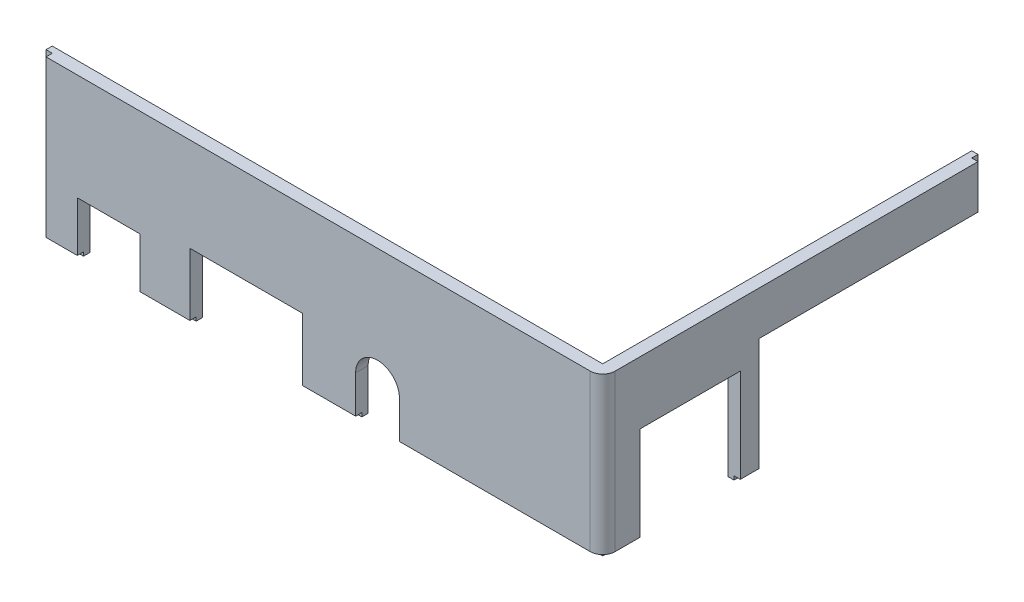
ISO-10303-21;
HEADER;
FILE_DESCRIPTION(('STEP AP214'),'2;1');
FILE_NAME('part.step','',(''),(''),'','','');
FILE_SCHEMA(('AUTOMOTIVE_DESIGN { 1 0 10303 214 1 1 1 1 }'));
ENDSEC;
DATA;
#1=APPLICATION_CONTEXT('core data for automotive mechanical design processes');
#2=APPLICATION_PROTOCOL_DEFINITION('international standard','automotive_design',2000,#1);
#3=PRODUCT_CONTEXT('',#1,'mechanical');
#4=PRODUCT('Part','Part','',(#3));
#5=PRODUCT_RELATED_PRODUCT_CATEGORY('part','',(#4));
#6=PRODUCT_DEFINITION_FORMATION('','',#4);
#7=PRODUCT_DEFINITION_CONTEXT('part definition',#1,'design');
#8=PRODUCT_DEFINITION('design','',#6,#7);
#9=PRODUCT_DEFINITION_SHAPE('','',#8);
#10=(LENGTH_UNIT() NAMED_UNIT(*) SI_UNIT(.MILLI.,.METRE.));
#11=(NAMED_UNIT(*) PLANE_ANGLE_UNIT() SI_UNIT($,.RADIAN.));
#12=(NAMED_UNIT(*) SI_UNIT($,.STERADIAN.) SOLID_ANGLE_UNIT());
#13=UNCERTAINTY_MEASURE_WITH_UNIT(LENGTH_MEASURE(1.E-05),#10,'distance_accuracy_value','');
#14=(GEOMETRIC_REPRESENTATION_CONTEXT(3) GLOBAL_UNCERTAINTY_ASSIGNED_CONTEXT((#13)) GLOBAL_UNIT_ASSIGNED_CONTEXT((#10,
#11,#12)) REPRESENTATION_CONTEXT('',''));
#15=CARTESIAN_POINT('',(0.,0.,0.));
#16=DIRECTION('',(0.,0.,1.));
#17=DIRECTION('',(1.,0.,0.));
#18=AXIS2_PLACEMENT_3D('',#15,#16,#17);
#19=CARTESIAN_POINT('',(0.,0.,0.));
#20=DIRECTION('',(0.,1.,0.));
#21=DIRECTION('',(0.,0.,1.));
#22=AXIS2_PLACEMENT_3D('',#19,#20,#21);
#23=PLANE('',#22);
#24=DIRECTION('',(0.,0.,-1.));
#25=VECTOR('',#24,1.);
#26=CARTESIAN_POINT('',(90.,0.,0.));
#27=LINE('',#26,#25);
#28=CARTESIAN_POINT('',(90.,0.,-2.));
#29=VERTEX_POINT('',#28);
#30=CARTESIAN_POINT('',(90.,0.,-6.));
#31=VERTEX_POINT('',#30);
#32=EDGE_CURVE('E359',#29,#31,#27,.T.);
#33=ORIENTED_EDGE('',*,*,#32,.F.);
#34=CARTESIAN_POINT('',(88.,0.,-2.));
#35=DIRECTION('',(0.,1.,0.));
#36=DIRECTION('',(0.,0.,1.));
#37=AXIS2_PLACEMENT_3D('',#34,#35,#36);
#38=CIRCLE('',#37,2.);
#39=CARTESIAN_POINT('',(88.,0.,0.));
#40=VERTEX_POINT('',#39);
#41=EDGE_CURVE('E82',#29,#40,#38,.F.);
#42=ORIENTED_EDGE('',*,*,#41,.T.);
#43=DIRECTION('',(1.,0.,0.));
#44=VECTOR('',#43,1.);
#45=CARTESIAN_POINT('',(0.,0.,0.));
#46=LINE('',#45,#44);
#47=CARTESIAN_POINT('',(57.5,0.,0.));
#48=VERTEX_POINT('',#47);
#49=EDGE_CURVE('E385',#48,#40,#46,.T.);
#50=ORIENTED_EDGE('',*,*,#49,.F.);
#51=DIRECTION('',(0.,0.,1.));
#52=VECTOR('',#51,1.);
#53=CARTESIAN_POINT('',(57.5,0.,-61.001));
#54=LINE('',#53,#52);
#55=CARTESIAN_POINT('',(57.5,0.,-1.));
#56=VERTEX_POINT('',#55);
#57=EDGE_CURVE('E488',#56,#48,#54,.T.);
#58=ORIENTED_EDGE('',*,*,#57,.F.);
#59=DIRECTION('',(1.,0.,0.));
#60=VECTOR('',#59,1.);
#61=CARTESIAN_POINT('',(0.,0.,-1.));
#62=LINE('',#61,#60);
#63=CARTESIAN_POINT('',(89.,0.,-1.));
#64=VERTEX_POINT('',#63);
#65=EDGE_CURVE('E338',#56,#64,#62,.T.);
#66=ORIENTED_EDGE('',*,*,#65,.T.);
#67=DIRECTION('',(0.,0.,1.));
#68=VECTOR('',#67,1.);
#69=CARTESIAN_POINT('',(89.,0.,-61.));
#70=LINE('',#69,#68);
#71=CARTESIAN_POINT('',(89.,0.,-6.));
#72=VERTEX_POINT('',#71);
#73=EDGE_CURVE('E339',#72,#64,#70,.T.);
#74=ORIENTED_EDGE('',*,*,#73,.F.);
#75=DIRECTION('',(-1.,0.,0.));
#76=VECTOR('',#75,1.);
#77=CARTESIAN_POINT('',(-0.001000000000001,0.,-6.));
#78=LINE('',#77,#76);
#79=EDGE_CURVE('E332',#31,#72,#78,.T.);
#80=ORIENTED_EDGE('',*,*,#79,.F.);
#81=EDGE_LOOP('',(#33,#42,#50,#58,#66,#74,#80));
#82=FACE_BOUND('',#81,.T.);
#83=ADVANCED_FACE('F60',(#82),#23,.F.);
#84=CARTESIAN_POINT('',(90.,0.,-22.));
#85=VERTEX_POINT('',#84);
#86=CARTESIAN_POINT('',(90.,0.,-25.));
#87=VERTEX_POINT('',#86);
#88=EDGE_CURVE('E331',#85,#87,#27,.T.);
#89=ORIENTED_EDGE('',*,*,#88,.F.);
#90=DIRECTION('',(1.,0.,0.));
#91=VECTOR('',#90,1.);
#92=CARTESIAN_POINT('',(-0.001000000000001,0.,-22.));
#93=LINE('',#92,#91);
#94=CARTESIAN_POINT('',(89.,0.,-22.));
#95=VERTEX_POINT('',#94);
#96=EDGE_CURVE('E313',#95,#85,#93,.T.);
#97=ORIENTED_EDGE('',*,*,#96,.F.);
#98=CARTESIAN_POINT('',(89.,0.,-25.));
#99=VERTEX_POINT('',#98);
#100=EDGE_CURVE('E329',#99,#95,#70,.T.);
#101=ORIENTED_EDGE('',*,*,#100,.F.);
#102=DIRECTION('',(-1.,0.,0.));
#103=VECTOR('',#102,1.);
#104=CARTESIAN_POINT('',(-0.001000000000001,0.,-25.));
#105=LINE('',#104,#103);
#106=EDGE_CURVE('E937',#87,#99,#105,.T.);
#107=ORIENTED_EDGE('',*,*,#106,.F.);
#108=EDGE_LOOP('',(#89,#97,#101,#107));
#109=FACE_BOUND('',#108,.T.);
#110=ADVANCED_FACE('F327',(#109),#23,.F.);
#111=CARTESIAN_POINT('',(0.,-0.6,0.));
#112=DIRECTION('',(0.,1.,0.));
#113=DIRECTION('',(0.,0.,1.));
#114=AXIS2_PLACEMENT_3D('',#111,#112,#113);
#115=PLANE('',#114);
#116=DIRECTION('',(0.,0.,1.));
#117=VECTOR('',#116,1.);
#118=CARTESIAN_POINT('',(88.,-0.6,-61.));
#119=LINE('',#118,#117);
#120=CARTESIAN_POINT('',(88.,-0.6,-6.));
#121=VERTEX_POINT('',#120);
#122=CARTESIAN_POINT('',(88.,-0.6,-2.));
#123=VERTEX_POINT('',#122);
#124=EDGE_CURVE('E427',#121,#123,#119,.T.);
#125=ORIENTED_EDGE('',*,*,#124,.F.);
#126=DIRECTION('',(1.,0.,0.));
#127=VECTOR('',#126,1.);
#128=CARTESIAN_POINT('',(-0.001000000000001,-0.6,-6.));
#129=LINE('',#128,#127);
#130=CARTESIAN_POINT('',(89.,-0.6,-6.));
#131=VERTEX_POINT('',#130);
#132=EDGE_CURVE('E956',#121,#131,#129,.T.);
#133=ORIENTED_EDGE('',*,*,#132,.T.);
#134=DIRECTION('',(0.,0.,1.));
#135=VECTOR('',#134,1.);
#136=CARTESIAN_POINT('',(89.,-0.6,-61.));
#137=LINE('',#136,#135);
#138=CARTESIAN_POINT('',(89.,-0.6,-1.));
#139=VERTEX_POINT('',#138);
#140=EDGE_CURVE('E348',#131,#139,#137,.T.);
#141=ORIENTED_EDGE('',*,*,#140,.T.);
#142=DIRECTION('',(1.,0.,0.));
#143=VECTOR('',#142,1.);
#144=CARTESIAN_POINT('',(0.,-0.6,-1.));
#145=LINE('',#144,#143);
#146=CARTESIAN_POINT('',(57.5,-0.6,-1.));
#147=VERTEX_POINT('',#146);
#148=EDGE_CURVE('E353',#147,#139,#145,.T.);
#149=ORIENTED_EDGE('',*,*,#148,.F.);
#150=DIRECTION('',(0.,0.,1.));
#151=VECTOR('',#150,1.);
#152=CARTESIAN_POINT('',(57.5,-0.6,-61.001));
#153=LINE('',#152,#151);
#154=CARTESIAN_POINT('',(57.5,-0.6,-2.));
#155=VERTEX_POINT('',#154);
#156=EDGE_CURVE('E511',#155,#147,#153,.T.);
#157=ORIENTED_EDGE('',*,*,#156,.F.);
#158=DIRECTION('',(1.,0.,0.));
#159=VECTOR('',#158,1.);
#160=CARTESIAN_POINT('',(0.,-0.6,-2.));
#161=LINE('',#160,#159);
#162=EDGE_CURVE('E522',#155,#123,#161,.T.);
#163=ORIENTED_EDGE('',*,*,#162,.T.);
#164=EDGE_LOOP('',(#125,#133,#141,#149,#157,#163));
#165=FACE_BOUND('',#164,.T.);
#166=ADVANCED_FACE('F679',(#165),#115,.F.);
#167=CARTESIAN_POINT('',(89.,-0.6,-25.));
#168=VERTEX_POINT('',#167);
#169=CARTESIAN_POINT('',(89.,-0.6,-22.));
#170=VERTEX_POINT('',#169);
#171=EDGE_CURVE('E354',#168,#170,#137,.T.);
#172=ORIENTED_EDGE('',*,*,#171,.T.);
#173=DIRECTION('',(1.,0.,0.));
#174=VECTOR('',#173,1.);
#175=CARTESIAN_POINT('',(-0.001000000000001,-0.599999999999998,-22.));
#176=LINE('',#175,#174);
#177=CARTESIAN_POINT('',(88.,-0.599999999999998,-22.));
#178=VERTEX_POINT('',#177);
#179=EDGE_CURVE('E316',#178,#170,#176,.T.);
#180=ORIENTED_EDGE('',*,*,#179,.F.);
#181=CARTESIAN_POINT('',(88.,-0.6,-25.));
#182=VERTEX_POINT('',#181);
#183=EDGE_CURVE('E428',#182,#178,#119,.T.);
#184=ORIENTED_EDGE('',*,*,#183,.F.);
#185=DIRECTION('',(1.,0.,0.));
#186=VECTOR('',#185,1.);
#187=CARTESIAN_POINT('',(-0.001000000000001,-0.6,-25.));
#188=LINE('',#187,#186);
#189=EDGE_CURVE('E947',#182,#168,#188,.T.);
#190=ORIENTED_EDGE('',*,*,#189,.T.);
#191=EDGE_LOOP('',(#172,#180,#184,#190));
#192=FACE_BOUND('',#191,.T.);
#193=ADVANCED_FACE('F696',(#192),#115,.F.);
#194=CARTESIAN_POINT('',(89.,25.,0.));
#195=DIRECTION('',(1.,0.,0.));
#196=DIRECTION('',(0.,0.,-1.));
#197=AXIS2_PLACEMENT_3D('',#194,#195,#196);
#198=PLANE('',#197);
#199=DIRECTION('',(0.,1.,0.));
#200=VECTOR('',#199,1.);
#201=CARTESIAN_POINT('',(89.,-0.6,-6.));
#202=LINE('',#201,#200);
#203=EDGE_CURVE('E321',#131,#72,#202,.T.);
#204=ORIENTED_EDGE('',*,*,#203,.T.);
#205=ORIENTED_EDGE('',*,*,#73,.T.);
#206=DIRECTION('',(0.,1.,0.));
#207=VECTOR('',#206,1.);
#208=CARTESIAN_POINT('',(89.,-0.6,-1.));
#209=LINE('',#208,#207);
#210=EDGE_CURVE('E350',#139,#64,#209,.T.);
#211=ORIENTED_EDGE('',*,*,#210,.F.);
#212=ORIENTED_EDGE('',*,*,#140,.F.);
#213=EDGE_LOOP('',(#204,#205,#211,#212));
#214=FACE_BOUND('',#213,.T.);
#215=ADVANCED_FACE('F581',(#214),#198,.T.);
#216=DIRECTION('',(0.,-1.,0.));
#217=VECTOR('',#216,1.);
#218=CARTESIAN_POINT('',(89.,-0.599999999999998,-22.));
#219=LINE('',#218,#217);
#220=EDGE_CURVE('E310',#95,#170,#219,.T.);
#221=ORIENTED_EDGE('',*,*,#220,.T.);
#222=ORIENTED_EDGE('',*,*,#171,.F.);
#223=DIRECTION('',(0.,1.,0.));
#224=VECTOR('',#223,1.);
#225=CARTESIAN_POINT('',(89.,-0.6,-25.));
#226=LINE('',#225,#224);
#227=EDGE_CURVE('E337',#168,#99,#226,.T.);
#228=ORIENTED_EDGE('',*,*,#227,.T.);
#229=ORIENTED_EDGE('',*,*,#100,.T.);
#230=EDGE_LOOP('',(#221,#222,#228,#229));
#231=FACE_BOUND('',#230,.T.);
#232=ADVANCED_FACE('F336',(#231),#198,.T.);
#233=CARTESIAN_POINT('',(0.,25.,-1.));
#234=DIRECTION('',(0.,0.,-1.));
#235=DIRECTION('',(-1.,0.,0.));
#236=AXIS2_PLACEMENT_3D('',#233,#234,#235);
#237=PLANE('',#236);
#238=CARTESIAN_POINT('',(0.,-0.6,-1.));
#239=VERTEX_POINT('',#238);
#240=CARTESIAN_POINT('',(5.99999999999999,-0.6,-1.));
#241=VERTEX_POINT('',#240);
#242=EDGE_CURVE('E520',#239,#241,#145,.T.);
#243=ORIENTED_EDGE('',*,*,#242,.T.);
#244=DIRECTION('',(0.,-1.,0.));
#245=VECTOR('',#244,1.);
#246=CARTESIAN_POINT('',(5.99999999999999,8.,-1.));
#247=LINE('',#246,#245);
#248=CARTESIAN_POINT('',(5.99999999999999,0.,-1.));
#249=VERTEX_POINT('',#248);
#250=EDGE_CURVE('E627',#249,#241,#247,.T.);
#251=ORIENTED_EDGE('',*,*,#250,.F.);
#252=CARTESIAN_POINT('',(1.,0.,-1.));
#253=VERTEX_POINT('',#252);
#254=EDGE_CURVE('E344',#253,#249,#62,.T.);
#255=ORIENTED_EDGE('',*,*,#254,.F.);
#256=DIRECTION('',(0.,-1.,0.));
#257=VECTOR('',#256,1.);
#258=CARTESIAN_POINT('',(1.,25.,-1.));
#259=LINE('',#258,#257);
#260=CARTESIAN_POINT('',(1.,25.,-1.));
#261=VERTEX_POINT('',#260);
#262=EDGE_CURVE('E399',#261,#253,#259,.T.);
#263=ORIENTED_EDGE('',*,*,#262,.F.);
#264=DIRECTION('',(1.,0.,0.));
#265=VECTOR('',#264,1.);
#266=CARTESIAN_POINT('',(0.,25.,-1.));
#267=LINE('',#266,#265);
#268=CARTESIAN_POINT('',(0.,25.,-1.));
#269=VERTEX_POINT('',#268);
#270=EDGE_CURVE('E370',#269,#261,#267,.T.);
#271=ORIENTED_EDGE('',*,*,#270,.F.);
#272=DIRECTION('',(0.,-1.,0.));
#273=VECTOR('',#272,1.);
#274=CARTESIAN_POINT('',(0.,25.,-1.));
#275=LINE('',#274,#273);
#276=EDGE_CURVE('E401',#269,#239,#275,.T.);
#277=ORIENTED_EDGE('',*,*,#276,.T.);
#278=EDGE_LOOP('',(#243,#251,#255,#263,#271,#277));
#279=FACE_BOUND('',#278,.T.);
#280=ADVANCED_FACE('F626',(#279),#237,.F.);
#281=CARTESIAN_POINT('',(16.,0.,-1.));
#282=VERTEX_POINT('',#281);
#283=CARTESIAN_POINT('',(24.,0.,-1.));
#284=VERTEX_POINT('',#283);
#285=EDGE_CURVE('E420',#282,#284,#62,.T.);
#286=ORIENTED_EDGE('',*,*,#285,.F.);
#287=DIRECTION('',(0.,1.,0.));
#288=VECTOR('',#287,1.);
#289=CARTESIAN_POINT('',(16.,8.,-1.));
#290=LINE('',#289,#288);
#291=CARTESIAN_POINT('',(16.,-0.599999999999999,-1.));
#292=VERTEX_POINT('',#291);
#293=EDGE_CURVE('E637',#292,#282,#290,.T.);
#294=ORIENTED_EDGE('',*,*,#293,.F.);
#295=CARTESIAN_POINT('',(24.,-0.6,-1.));
#296=VERTEX_POINT('',#295);
#297=EDGE_CURVE('E523',#292,#296,#145,.T.);
#298=ORIENTED_EDGE('',*,*,#297,.T.);
#299=DIRECTION('',(0.,-1.,0.));
#300=VECTOR('',#299,1.);
#301=CARTESIAN_POINT('',(24.,-0.6,-1.));
#302=LINE('',#301,#300);
#303=EDGE_CURVE('E457',#284,#296,#302,.T.);
#304=ORIENTED_EDGE('',*,*,#303,.F.);
#305=EDGE_LOOP('',(#286,#294,#298,#304));
#306=FACE_BOUND('',#305,.T.);
#307=ADVANCED_FACE('F1012',(#306),#237,.F.);
#308=ORIENTED_EDGE('',*,*,#65,.F.);
#309=DIRECTION('',(0.,1.,0.));
#310=VECTOR('',#309,1.);
#311=CARTESIAN_POINT('',(57.5,6.,-1.));
#312=LINE('',#311,#310);
#313=EDGE_CURVE('E491',#147,#56,#312,.T.);
#314=ORIENTED_EDGE('',*,*,#313,.F.);
#315=ORIENTED_EDGE('',*,*,#148,.T.);
#316=ORIENTED_EDGE('',*,*,#210,.T.);
#317=EDGE_LOOP('',(#308,#314,#315,#316));
#318=FACE_BOUND('',#317,.T.);
#319=ADVANCED_FACE('F577',(#318),#237,.F.);
#320=ORIENTED_EDGE('',*,*,#254,.T.);
#321=DIRECTION('',(0.,0.,-1.));
#322=VECTOR('',#321,1.);
#323=CARTESIAN_POINT('',(5.99999999999999,0.,-61.001));
#324=LINE('',#323,#322);
#325=CARTESIAN_POINT('',(5.99999999999999,0.,0.));
#326=VERTEX_POINT('',#325);
#327=EDGE_CURVE('E636',#326,#249,#324,.T.);
#328=ORIENTED_EDGE('',*,*,#327,.F.);
#329=CARTESIAN_POINT('',(1.,0.,0.));
#330=VERTEX_POINT('',#329);
#331=EDGE_CURVE('E387',#330,#326,#46,.T.);
#332=ORIENTED_EDGE('',*,*,#331,.F.);
#333=DIRECTION('',(0.,0.,-1.));
#334=VECTOR('',#333,1.);
#335=CARTESIAN_POINT('',(1.,0.,0.));
#336=LINE('',#335,#334);
#337=EDGE_CURVE('E382',#330,#253,#336,.T.);
#338=ORIENTED_EDGE('',*,*,#337,.T.);
#339=EDGE_LOOP('',(#320,#328,#332,#338));
#340=FACE_BOUND('',#339,.T.);
#341=ADVANCED_FACE('F635',(#340),#23,.F.);
#342=CARTESIAN_POINT('',(16.,0.,0.));
#343=VERTEX_POINT('',#342);
#344=CARTESIAN_POINT('',(24.,0.,0.));
#345=VERTEX_POINT('',#344);
#346=EDGE_CURVE('E390',#343,#345,#46,.T.);
#347=ORIENTED_EDGE('',*,*,#346,.F.);
#348=DIRECTION('',(0.,0.,1.));
#349=VECTOR('',#348,1.);
#350=CARTESIAN_POINT('',(16.,0.,-61.001));
#351=LINE('',#350,#349);
#352=EDGE_CURVE('E479',#282,#343,#351,.T.);
#353=ORIENTED_EDGE('',*,*,#352,.F.);
#354=ORIENTED_EDGE('',*,*,#285,.T.);
#355=DIRECTION('',(0.,0.,-1.));
#356=VECTOR('',#355,1.);
#357=CARTESIAN_POINT('',(24.,0.,-61.001));
#358=LINE('',#357,#356);
#359=EDGE_CURVE('E452',#345,#284,#358,.T.);
#360=ORIENTED_EDGE('',*,*,#359,.F.);
#361=EDGE_LOOP('',(#347,#353,#354,#360));
#362=FACE_BOUND('',#361,.T.);
#363=ADVANCED_FACE('F683',(#362),#23,.F.);
#364=CARTESIAN_POINT('',(0.,-0.6,-2.));
#365=VERTEX_POINT('',#364);
#366=CARTESIAN_POINT('',(5.99999999999999,-0.6,-2.));
#367=VERTEX_POINT('',#366);
#368=EDGE_CURVE('E524',#365,#367,#161,.T.);
#369=ORIENTED_EDGE('',*,*,#368,.T.);
#370=DIRECTION('',(0.,0.,1.));
#371=VECTOR('',#370,1.);
#372=CARTESIAN_POINT('',(5.99999999999999,-0.6,-61.001));
#373=LINE('',#372,#371);
#374=EDGE_CURVE('E447',#367,#241,#373,.T.);
#375=ORIENTED_EDGE('',*,*,#374,.T.);
#376=ORIENTED_EDGE('',*,*,#242,.F.);
#377=DIRECTION('',(0.,0.,-1.));
#378=VECTOR('',#377,1.);
#379=CARTESIAN_POINT('',(0.,-0.6,-1.));
#380=LINE('',#379,#378);
#381=EDGE_CURVE('E386',#239,#365,#380,.T.);
#382=ORIENTED_EDGE('',*,*,#381,.T.);
#383=EDGE_LOOP('',(#369,#375,#376,#382));
#384=FACE_BOUND('',#383,.T.);
#385=ADVANCED_FACE('F623',(#384),#115,.F.);
#386=ORIENTED_EDGE('',*,*,#297,.F.);
#387=DIRECTION('',(0.,0.,1.));
#388=VECTOR('',#387,1.);
#389=CARTESIAN_POINT('',(16.,-0.599999999999999,-61.001));
#390=LINE('',#389,#388);
#391=CARTESIAN_POINT('',(16.,-0.6,-2.));
#392=VERTEX_POINT('',#391);
#393=EDGE_CURVE('E440',#392,#292,#390,.T.);
#394=ORIENTED_EDGE('',*,*,#393,.F.);
#395=CARTESIAN_POINT('',(24.,-0.6,-2.));
#396=VERTEX_POINT('',#395);
#397=EDGE_CURVE('E526',#392,#396,#161,.T.);
#398=ORIENTED_EDGE('',*,*,#397,.T.);
#399=DIRECTION('',(0.,0.,1.));
#400=VECTOR('',#399,1.);
#401=CARTESIAN_POINT('',(24.,-0.6,-61.001));
#402=LINE('',#401,#400);
#403=EDGE_CURVE('E476',#396,#296,#402,.T.);
#404=ORIENTED_EDGE('',*,*,#403,.T.);
#405=EDGE_LOOP('',(#386,#394,#398,#404));
#406=FACE_BOUND('',#405,.T.);
#407=ADVANCED_FACE('F689',(#406),#115,.F.);
#408=DIRECTION('',(0.,0.,-1.));
#409=VECTOR('',#408,1.);
#410=CARTESIAN_POINT('',(89.,18.,-42.));
#411=LINE('',#410,#409);
#412=CARTESIAN_POINT('',(89.,18.,-60.));
#413=VERTEX_POINT('',#412);
#414=CARTESIAN_POINT('',(89.,18.,-61.));
#415=VERTEX_POINT('',#414);
#416=EDGE_CURVE('E610',#413,#415,#411,.T.);
#417=ORIENTED_EDGE('',*,*,#416,.T.);
#418=DIRECTION('',(0.,-1.,0.));
#419=VECTOR('',#418,1.);
#420=CARTESIAN_POINT('',(89.,25.,-61.));
#421=LINE('',#420,#419);
#422=CARTESIAN_POINT('',(89.,25.,-61.));
#423=VERTEX_POINT('',#422);
#424=EDGE_CURVE('E345',#423,#415,#421,.T.);
#425=ORIENTED_EDGE('',*,*,#424,.F.);
#426=DIRECTION('',(0.,0.,1.));
#427=VECTOR('',#426,1.);
#428=CARTESIAN_POINT('',(89.,25.,0.));
#429=LINE('',#428,#427);
#430=CARTESIAN_POINT('',(89.,25.,-60.));
#431=VERTEX_POINT('',#430);
#432=EDGE_CURVE('E355',#423,#431,#429,.T.);
#433=ORIENTED_EDGE('',*,*,#432,.T.);
#434=DIRECTION('',(0.,-1.,0.));
#435=VECTOR('',#434,1.);
#436=CARTESIAN_POINT('',(89.,25.,-60.));
#437=LINE('',#436,#435);
#438=EDGE_CURVE('E381',#431,#413,#437,.T.);
#439=ORIENTED_EDGE('',*,*,#438,.T.);
#440=EDGE_LOOP('',(#417,#425,#433,#439));
#441=FACE_BOUND('',#440,.T.);
#442=ADVANCED_FACE('F609',(#441),#198,.T.);
#443=CARTESIAN_POINT('',(0.,25.,-61.));
#444=DIRECTION('',(0.,0.,1.));
#445=DIRECTION('',(1.,0.,0.));
#446=AXIS2_PLACEMENT_3D('',#443,#444,#445);
#447=PLANE('',#446);
#448=ORIENTED_EDGE('',*,*,#424,.T.);
#449=DIRECTION('',(1.,0.,0.));
#450=VECTOR('',#449,1.);
#451=CARTESIAN_POINT('',(-0.001000000000001,18.,-61.));
#452=LINE('',#451,#450);
#453=CARTESIAN_POINT('',(88.,18.,-61.));
#454=VERTEX_POINT('',#453);
#455=EDGE_CURVE('E614',#454,#415,#452,.T.);
#456=ORIENTED_EDGE('',*,*,#455,.F.);
#457=DIRECTION('',(0.,-1.,0.));
#458=VECTOR('',#457,1.);
#459=CARTESIAN_POINT('',(88.,25.,-61.));
#460=LINE('',#459,#458);
#461=CARTESIAN_POINT('',(88.,25.,-61.));
#462=VERTEX_POINT('',#461);
#463=EDGE_CURVE('E408',#462,#454,#460,.T.);
#464=ORIENTED_EDGE('',*,*,#463,.F.);
#465=DIRECTION('',(-1.,0.,0.));
#466=VECTOR('',#465,1.);
#467=CARTESIAN_POINT('',(0.,25.,-61.));
#468=LINE('',#467,#466);
#469=EDGE_CURVE('E358',#423,#462,#468,.T.);
#470=ORIENTED_EDGE('',*,*,#469,.F.);
#471=EDGE_LOOP('',(#448,#456,#464,#470));
#472=FACE_BOUND('',#471,.T.);
#473=ADVANCED_FACE('F613',(#472),#447,.F.);
#474=CARTESIAN_POINT('',(88.,25.,0.));
#475=DIRECTION('',(-1.,0.,0.));
#476=DIRECTION('',(0.,0.,1.));
#477=AXIS2_PLACEMENT_3D('',#474,#475,#476);
#478=PLANE('',#477);
#479=ORIENTED_EDGE('',*,*,#463,.T.);
#480=DIRECTION('',(0.,0.,1.));
#481=VECTOR('',#480,1.);
#482=CARTESIAN_POINT('',(88.,18.,-25.));
#483=LINE('',#482,#481);
#484=CARTESIAN_POINT('',(88.,18.,-25.));
#485=VERTEX_POINT('',#484);
#486=EDGE_CURVE('E934',#454,#485,#483,.T.);
#487=ORIENTED_EDGE('',*,*,#486,.T.);
#488=DIRECTION('',(0.,-1.,0.));
#489=VECTOR('',#488,1.);
#490=CARTESIAN_POINT('',(88.,-0.6,-25.));
#491=LINE('',#490,#489);
#492=EDGE_CURVE('E936',#485,#182,#491,.T.);
#493=ORIENTED_EDGE('',*,*,#492,.T.);
#494=ORIENTED_EDGE('',*,*,#183,.T.);
#495=DIRECTION('',(0.,1.,0.));
#496=VECTOR('',#495,1.);
#497=CARTESIAN_POINT('',(88.,-0.599999999999998,-22.));
#498=LINE('',#497,#496);
#499=CARTESIAN_POINT('',(88.,15.,-22.));
#500=VERTEX_POINT('',#499);
#501=EDGE_CURVE('E976',#178,#500,#498,.T.);
#502=ORIENTED_EDGE('',*,*,#501,.T.);
#503=DIRECTION('',(0.,0.,1.));
#504=VECTOR('',#503,1.);
#505=CARTESIAN_POINT('',(88.,15.,-6.));
#506=LINE('',#505,#504);
#507=CARTESIAN_POINT('',(88.,15.,-6.));
#508=VERTEX_POINT('',#507);
#509=EDGE_CURVE('E973',#500,#508,#506,.T.);
#510=ORIENTED_EDGE('',*,*,#509,.T.);
#511=DIRECTION('',(0.,-1.,0.));
#512=VECTOR('',#511,1.);
#513=CARTESIAN_POINT('',(88.,-0.6,-6.));
#514=LINE('',#513,#512);
#515=EDGE_CURVE('E322',#508,#121,#514,.T.);
#516=ORIENTED_EDGE('',*,*,#515,.T.);
#517=ORIENTED_EDGE('',*,*,#124,.T.);
#518=DIRECTION('',(0.,-1.,0.));
#519=VECTOR('',#518,1.);
#520=CARTESIAN_POINT('',(88.,25.,-2.));
#521=LINE('',#520,#519);
#522=CARTESIAN_POINT('',(88.,25.,-2.));
#523=VERTEX_POINT('',#522);
#524=EDGE_CURVE('E405',#523,#123,#521,.T.);
#525=ORIENTED_EDGE('',*,*,#524,.F.);
#526=DIRECTION('',(0.,0.,-1.));
#527=VECTOR('',#526,1.);
#528=CARTESIAN_POINT('',(88.,25.,0.));
#529=LINE('',#528,#527);
#530=EDGE_CURVE('E361',#523,#462,#529,.T.);
#531=ORIENTED_EDGE('',*,*,#530,.T.);
#532=EDGE_LOOP('',(#479,#487,#493,#494,#502,#510,#516,#517,#525,#531));
#533=FACE_BOUND('',#532,.T.);
#534=ADVANCED_FACE('F616',(#533),#478,.T.);
#535=CARTESIAN_POINT('',(0.,25.,-2.));
#536=DIRECTION('',(0.,0.,-1.));
#537=DIRECTION('',(-1.,0.,0.));
#538=AXIS2_PLACEMENT_3D('',#535,#536,#537);
#539=PLANE('',#538);
#540=DIRECTION('',(0.,-1.,0.));
#541=VECTOR('',#540,1.);
#542=CARTESIAN_POINT('',(5.99999999999999,8.,-2.));
#543=LINE('',#542,#541);
#544=CARTESIAN_POINT('',(5.99999999999999,8.,-2.));
#545=VERTEX_POINT('',#544);
#546=EDGE_CURVE('E650',#545,#367,#543,.T.);
#547=ORIENTED_EDGE('',*,*,#546,.T.);
#548=ORIENTED_EDGE('',*,*,#368,.F.);
#549=DIRECTION('',(0.,-1.,0.));
#550=VECTOR('',#549,1.);
#551=CARTESIAN_POINT('',(0.,25.,-2.));
#552=LINE('',#551,#550);
#553=CARTESIAN_POINT('',(0.,25.,-2.));
#554=VERTEX_POINT('',#553);
#555=EDGE_CURVE('E403',#554,#365,#552,.T.);
#556=ORIENTED_EDGE('',*,*,#555,.F.);
#557=DIRECTION('',(1.,0.,0.));
#558=VECTOR('',#557,1.);
#559=CARTESIAN_POINT('',(0.,25.,-2.));
#560=LINE('',#559,#558);
#561=EDGE_CURVE('E364',#554,#523,#560,.T.);
#562=ORIENTED_EDGE('',*,*,#561,.T.);
#563=ORIENTED_EDGE('',*,*,#524,.T.);
#564=ORIENTED_EDGE('',*,*,#162,.F.);
#565=DIRECTION('',(0.,1.,0.));
#566=VECTOR('',#565,1.);
#567=CARTESIAN_POINT('',(57.5,6.,-2.));
#568=LINE('',#567,#566);
#569=CARTESIAN_POINT('',(57.5,6.,-2.));
#570=VERTEX_POINT('',#569);
#571=EDGE_CURVE('E496',#155,#570,#568,.T.);
#572=ORIENTED_EDGE('',*,*,#571,.T.);
#573=CARTESIAN_POINT('',(54.,6.,-2.));
#574=DIRECTION('',(0.,0.,-1.));
#575=DIRECTION('',(-1.,0.,0.));
#576=AXIS2_PLACEMENT_3D('',#573,#574,#575);
#577=CIRCLE('',#576,3.5);
#578=CARTESIAN_POINT('',(50.5,6.,-2.));
#579=VERTEX_POINT('',#578);
#580=EDGE_CURVE('E493',#570,#579,#577,.F.);
#581=ORIENTED_EDGE('',*,*,#580,.T.);
#582=DIRECTION('',(0.,-1.,0.));
#583=VECTOR('',#582,1.);
#584=CARTESIAN_POINT('',(50.5,6.,-2.));
#585=LINE('',#584,#583);
#586=CARTESIAN_POINT('',(50.5,-0.6,-2.));
#587=VERTEX_POINT('',#586);
#588=EDGE_CURVE('E453',#579,#587,#585,.T.);
#589=ORIENTED_EDGE('',*,*,#588,.T.);
#590=CARTESIAN_POINT('',(42.,-0.6,-2.));
#591=VERTEX_POINT('',#590);
#592=EDGE_CURVE('E531',#591,#587,#161,.T.);
#593=ORIENTED_EDGE('',*,*,#592,.F.);
#594=DIRECTION('',(0.,1.,0.));
#595=VECTOR('',#594,1.);
#596=CARTESIAN_POINT('',(42.,-0.599999999999998,-2.));
#597=LINE('',#596,#595);
#598=CARTESIAN_POINT('',(42.,10.,-2.));
#599=VERTEX_POINT('',#598);
#600=EDGE_CURVE('E459',#591,#599,#597,.T.);
#601=ORIENTED_EDGE('',*,*,#600,.T.);
#602=DIRECTION('',(-1.,0.,0.));
#603=VECTOR('',#602,1.);
#604=CARTESIAN_POINT('',(24.,10.,-2.));
#605=LINE('',#604,#603);
#606=CARTESIAN_POINT('',(24.,10.,-2.));
#607=VERTEX_POINT('',#606);
#608=EDGE_CURVE('E462',#599,#607,#605,.T.);
#609=ORIENTED_EDGE('',*,*,#608,.T.);
#610=DIRECTION('',(0.,-1.,0.));
#611=VECTOR('',#610,1.);
#612=CARTESIAN_POINT('',(24.,-0.6,-2.));
#613=LINE('',#612,#611);
#614=EDGE_CURVE('E465',#607,#396,#613,.T.);
#615=ORIENTED_EDGE('',*,*,#614,.T.);
#616=ORIENTED_EDGE('',*,*,#397,.F.);
#617=DIRECTION('',(0.,1.,0.));
#618=VECTOR('',#617,1.);
#619=CARTESIAN_POINT('',(16.,8.,-2.));
#620=LINE('',#619,#618);
#621=CARTESIAN_POINT('',(16.,8.,-2.));
#622=VERTEX_POINT('',#621);
#623=EDGE_CURVE('E644',#392,#622,#620,.T.);
#624=ORIENTED_EDGE('',*,*,#623,.T.);
#625=DIRECTION('',(-1.,0.,0.));
#626=VECTOR('',#625,1.);
#627=CARTESIAN_POINT('',(5.99999999999999,8.,-2.));
#628=LINE('',#627,#626);
#629=EDGE_CURVE('E647',#622,#545,#628,.T.);
#630=ORIENTED_EDGE('',*,*,#629,.T.);
#631=EDGE_LOOP('',(#547,#548,#556,#562,#563,#564,#572,#581,#589,#593,#601,#609,#615,#616,#624,#630));
#632=FACE_BOUND('',#631,.T.);
#633=ADVANCED_FACE('F544',(#632),#539,.T.);
#634=CARTESIAN_POINT('',(0.,25.,0.));
#635=DIRECTION('',(-1.,0.,0.));
#636=DIRECTION('',(0.,0.,1.));
#637=AXIS2_PLACEMENT_3D('',#634,#635,#636);
#638=PLANE('',#637);
#639=ORIENTED_EDGE('',*,*,#555,.T.);
#640=ORIENTED_EDGE('',*,*,#381,.F.);
#641=ORIENTED_EDGE('',*,*,#276,.F.);
#642=DIRECTION('',(0.,0.,-1.));
#643=VECTOR('',#642,1.);
#644=CARTESIAN_POINT('',(0.,25.,0.));
#645=LINE('',#644,#643);
#646=EDGE_CURVE('E367',#269,#554,#645,.T.);
#647=ORIENTED_EDGE('',*,*,#646,.T.);
#648=EDGE_LOOP('',(#639,#640,#641,#647));
#649=FACE_BOUND('',#648,.T.);
#650=ADVANCED_FACE('F621',(#649),#638,.T.);
#651=CARTESIAN_POINT('',(42.,0.,-1.));
#652=VERTEX_POINT('',#651);
#653=CARTESIAN_POINT('',(50.5,0.,-1.));
#654=VERTEX_POINT('',#653);
#655=EDGE_CURVE('E342',#652,#654,#62,.T.);
#656=ORIENTED_EDGE('',*,*,#655,.F.);
#657=DIRECTION('',(0.,1.,0.));
#658=VECTOR('',#657,1.);
#659=CARTESIAN_POINT('',(42.,-0.599999999999998,-1.));
#660=LINE('',#659,#658);
#661=CARTESIAN_POINT('',(42.,-0.6,-1.));
#662=VERTEX_POINT('',#661);
#663=EDGE_CURVE('E455',#662,#652,#660,.T.);
#664=ORIENTED_EDGE('',*,*,#663,.F.);
#665=CARTESIAN_POINT('',(50.5,-0.6,-1.));
#666=VERTEX_POINT('',#665);
#667=EDGE_CURVE('E569',#662,#666,#145,.T.);
#668=ORIENTED_EDGE('',*,*,#667,.T.);
#669=DIRECTION('',(0.,-1.,0.));
#670=VECTOR('',#669,1.);
#671=CARTESIAN_POINT('',(50.5,6.,-1.));
#672=LINE('',#671,#670);
#673=EDGE_CURVE('E510',#654,#666,#672,.T.);
#674=ORIENTED_EDGE('',*,*,#673,.F.);
#675=EDGE_LOOP('',(#656,#664,#668,#674));
#676=FACE_BOUND('',#675,.T.);
#677=ADVANCED_FACE('F568',(#676),#237,.F.);
#678=CARTESIAN_POINT('',(1.,25.,0.));
#679=DIRECTION('',(-1.,0.,0.));
#680=DIRECTION('',(0.,0.,1.));
#681=AXIS2_PLACEMENT_3D('',#678,#679,#680);
#682=PLANE('',#681);
#683=ORIENTED_EDGE('',*,*,#337,.F.);
#684=DIRECTION('',(0.,-1.,0.));
#685=VECTOR('',#684,1.);
#686=CARTESIAN_POINT('',(1.,25.,0.));
#687=LINE('',#686,#685);
#688=CARTESIAN_POINT('',(1.,25.,0.));
#689=VERTEX_POINT('',#688);
#690=EDGE_CURVE('E397',#689,#330,#687,.T.);
#691=ORIENTED_EDGE('',*,*,#690,.F.);
#692=DIRECTION('',(0.,0.,-1.));
#693=VECTOR('',#692,1.);
#694=CARTESIAN_POINT('',(1.,25.,0.));
#695=LINE('',#694,#693);
#696=EDGE_CURVE('E372',#689,#261,#695,.T.);
#697=ORIENTED_EDGE('',*,*,#696,.T.);
#698=ORIENTED_EDGE('',*,*,#262,.T.);
#699=EDGE_LOOP('',(#683,#691,#697,#698));
#700=FACE_BOUND('',#699,.T.);
#701=ADVANCED_FACE('F632',(#700),#682,.T.);
#702=CARTESIAN_POINT('',(0.,25.,0.));
#703=DIRECTION('',(0.,0.,-1.));
#704=DIRECTION('',(-1.,0.,0.));
#705=AXIS2_PLACEMENT_3D('',#702,#703,#704);
#706=PLANE('',#705);
#707=ORIENTED_EDGE('',*,*,#49,.T.);
#708=DIRECTION('',(0.,-1.,0.));
#709=VECTOR('',#708,1.);
#710=CARTESIAN_POINT('',(88.,25.,0.));
#711=LINE('',#710,#709);
#712=CARTESIAN_POINT('',(88.,25.,0.));
#713=VERTEX_POINT('',#712);
#714=EDGE_CURVE('E68',#40,#713,#711,.F.);
#715=ORIENTED_EDGE('',*,*,#714,.T.);
#716=DIRECTION('',(1.,0.,0.));
#717=VECTOR('',#716,1.);
#718=CARTESIAN_POINT('',(0.,25.,0.));
#719=LINE('',#718,#717);
#720=EDGE_CURVE('E375',#689,#713,#719,.T.);
#721=ORIENTED_EDGE('',*,*,#720,.F.);
#722=ORIENTED_EDGE('',*,*,#690,.T.);
#723=ORIENTED_EDGE('',*,*,#331,.T.);
#724=DIRECTION('',(0.,-1.,0.));
#725=VECTOR('',#724,1.);
#726=CARTESIAN_POINT('',(5.99999999999999,8.,0.));
#727=LINE('',#726,#725);
#728=CARTESIAN_POINT('',(5.99999999999999,8.,0.));
#729=VERTEX_POINT('',#728);
#730=EDGE_CURVE('E652',#729,#326,#727,.T.);
#731=ORIENTED_EDGE('',*,*,#730,.F.);
#732=DIRECTION('',(-1.,0.,0.));
#733=VECTOR('',#732,1.);
#734=CARTESIAN_POINT('',(5.99999999999999,8.,0.));
#735=LINE('',#734,#733);
#736=CARTESIAN_POINT('',(16.,8.,0.));
#737=VERTEX_POINT('',#736);
#738=EDGE_CURVE('E443',#737,#729,#735,.T.);
#739=ORIENTED_EDGE('',*,*,#738,.F.);
#740=DIRECTION('',(0.,1.,0.));
#741=VECTOR('',#740,1.);
#742=CARTESIAN_POINT('',(16.,8.,0.));
#743=LINE('',#742,#741);
#744=EDGE_CURVE('E653',#343,#737,#743,.T.);
#745=ORIENTED_EDGE('',*,*,#744,.F.);
#746=ORIENTED_EDGE('',*,*,#346,.T.);
#747=DIRECTION('',(0.,-1.,0.));
#748=VECTOR('',#747,1.);
#749=CARTESIAN_POINT('',(24.,-0.6,0.));
#750=LINE('',#749,#748);
#751=CARTESIAN_POINT('',(24.,10.,0.));
#752=VERTEX_POINT('',#751);
#753=EDGE_CURVE('E468',#752,#345,#750,.T.);
#754=ORIENTED_EDGE('',*,*,#753,.F.);
#755=DIRECTION('',(-1.,0.,0.));
#756=VECTOR('',#755,1.);
#757=CARTESIAN_POINT('',(24.,10.,0.));
#758=LINE('',#757,#756);
#759=CARTESIAN_POINT('',(42.,10.,0.));
#760=VERTEX_POINT('',#759);
#761=EDGE_CURVE('E473',#760,#752,#758,.T.);
#762=ORIENTED_EDGE('',*,*,#761,.F.);
#763=DIRECTION('',(0.,1.,0.));
#764=VECTOR('',#763,1.);
#765=CARTESIAN_POINT('',(42.,-0.599999999999998,0.));
#766=LINE('',#765,#764);
#767=CARTESIAN_POINT('',(42.,0.,0.));
#768=VERTEX_POINT('',#767);
#769=EDGE_CURVE('E470',#768,#760,#766,.T.);
#770=ORIENTED_EDGE('',*,*,#769,.F.);
#771=CARTESIAN_POINT('',(50.5,0.,0.));
#772=VERTEX_POINT('',#771);
#773=EDGE_CURVE('E558',#768,#772,#46,.T.);
#774=ORIENTED_EDGE('',*,*,#773,.T.);
#775=DIRECTION('',(0.,-1.,0.));
#776=VECTOR('',#775,1.);
#777=CARTESIAN_POINT('',(50.5,6.,0.));
#778=LINE('',#777,#776);
#779=CARTESIAN_POINT('',(50.5,6.,0.));
#780=VERTEX_POINT('',#779);
#781=EDGE_CURVE('E502',#780,#772,#778,.T.);
#782=ORIENTED_EDGE('',*,*,#781,.F.);
#783=CARTESIAN_POINT('',(54.,6.,0.));
#784=DIRECTION('',(0.,0.,1.));
#785=DIRECTION('',(-1.,0.,0.));
#786=AXIS2_PLACEMENT_3D('',#783,#784,#785);
#787=CIRCLE('',#786,3.5);
#788=CARTESIAN_POINT('',(57.5,6.,0.));
#789=VERTEX_POINT('',#788);
#790=EDGE_CURVE('E499',#789,#780,#787,.T.);
#791=ORIENTED_EDGE('',*,*,#790,.F.);
#792=DIRECTION('',(0.,1.,0.));
#793=VECTOR('',#792,1.);
#794=CARTESIAN_POINT('',(57.5,6.,0.));
#795=LINE('',#794,#793);
#796=EDGE_CURVE('E504',#48,#789,#795,.T.);
#797=ORIENTED_EDGE('',*,*,#796,.F.);
#798=EDGE_LOOP('',(#707,#715,#721,#722,#723,#731,#739,#745,#746,#754,#762,#770,#774,#782,#791,#797));
#799=FACE_BOUND('',#798,.T.);
#800=ADVANCED_FACE('F555',(#799),#706,.F.);
#801=CARTESIAN_POINT('',(90.,25.,0.));
#802=DIRECTION('',(-1.,0.,0.));
#803=DIRECTION('',(0.,0.,1.));
#804=AXIS2_PLACEMENT_3D('',#801,#802,#803);
#805=PLANE('',#804);
#806=DIRECTION('',(0.,0.,1.));
#807=VECTOR('',#806,1.);
#808=CARTESIAN_POINT('',(90.,18.,-25.));
#809=LINE('',#808,#807);
#810=CARTESIAN_POINT('',(90.,18.,-60.));
#811=VERTEX_POINT('',#810);
#812=CARTESIAN_POINT('',(90.,18.,-25.));
#813=VERTEX_POINT('',#812);
#814=EDGE_CURVE('E597',#811,#813,#809,.T.);
#815=ORIENTED_EDGE('',*,*,#814,.F.);
#816=DIRECTION('',(0.,-1.,0.));
#817=VECTOR('',#816,1.);
#818=CARTESIAN_POINT('',(90.,25.,-60.));
#819=LINE('',#818,#817);
#820=CARTESIAN_POINT('',(90.,25.,-60.));
#821=VERTEX_POINT('',#820);
#822=EDGE_CURVE('E394',#821,#811,#819,.T.);
#823=ORIENTED_EDGE('',*,*,#822,.F.);
#824=DIRECTION('',(0.,0.,-1.));
#825=VECTOR('',#824,1.);
#826=CARTESIAN_POINT('',(90.,25.,0.));
#827=LINE('',#826,#825);
#828=CARTESIAN_POINT('',(90.,25.,-2.));
#829=VERTEX_POINT('',#828);
#830=EDGE_CURVE('E377',#829,#821,#827,.T.);
#831=ORIENTED_EDGE('',*,*,#830,.F.);
#832=DIRECTION('',(0.,-1.,0.));
#833=VECTOR('',#832,1.);
#834=CARTESIAN_POINT('',(90.,25.,-2.));
#835=LINE('',#834,#833);
#836=EDGE_CURVE('E413',#829,#29,#835,.T.);
#837=ORIENTED_EDGE('',*,*,#836,.T.);
#838=ORIENTED_EDGE('',*,*,#32,.T.);
#839=DIRECTION('',(0.,-1.,0.));
#840=VECTOR('',#839,1.);
#841=CARTESIAN_POINT('',(90.,-0.6,-6.));
#842=LINE('',#841,#840);
#843=CARTESIAN_POINT('',(90.,15.,-6.));
#844=VERTEX_POINT('',#843);
#845=EDGE_CURVE('E968',#844,#31,#842,.T.);
#846=ORIENTED_EDGE('',*,*,#845,.F.);
#847=DIRECTION('',(0.,0.,1.));
#848=VECTOR('',#847,1.);
#849=CARTESIAN_POINT('',(90.,15.,-6.));
#850=LINE('',#849,#848);
#851=CARTESIAN_POINT('',(90.,15.,-22.));
#852=VERTEX_POINT('',#851);
#853=EDGE_CURVE('E961',#852,#844,#850,.T.);
#854=ORIENTED_EDGE('',*,*,#853,.F.);
#855=DIRECTION('',(0.,1.,0.));
#856=VECTOR('',#855,1.);
#857=CARTESIAN_POINT('',(90.,-0.599999999999998,-22.));
#858=LINE('',#857,#856);
#859=EDGE_CURVE('E966',#85,#852,#858,.T.);
#860=ORIENTED_EDGE('',*,*,#859,.F.);
#861=ORIENTED_EDGE('',*,*,#88,.T.);
#862=DIRECTION('',(0.,-1.,0.));
#863=VECTOR('',#862,1.);
#864=CARTESIAN_POINT('',(90.,-0.6,-25.));
#865=LINE('',#864,#863);
#866=EDGE_CURVE('E944',#813,#87,#865,.T.);
#867=ORIENTED_EDGE('',*,*,#866,.F.);
#868=EDGE_LOOP('',(#815,#823,#831,#837,#838,#846,#854,#860,#861,#867));
#869=FACE_BOUND('',#868,.T.);
#870=ADVANCED_FACE('F593',(#869),#805,.F.);
#871=CARTESIAN_POINT('',(0.,25.,-60.));
#872=DIRECTION('',(0.,0.,1.));
#873=DIRECTION('',(1.,0.,0.));
#874=AXIS2_PLACEMENT_3D('',#871,#872,#873);
#875=PLANE('',#874);
#876=ORIENTED_EDGE('',*,*,#822,.T.);
#877=DIRECTION('',(1.,0.,0.));
#878=VECTOR('',#877,1.);
#879=CARTESIAN_POINT('',(-0.001000000000001,18.,-60.));
#880=LINE('',#879,#878);
#881=EDGE_CURVE('E951',#413,#811,#880,.T.);
#882=ORIENTED_EDGE('',*,*,#881,.F.);
#883=ORIENTED_EDGE('',*,*,#438,.F.);
#884=DIRECTION('',(-1.,0.,0.));
#885=VECTOR('',#884,1.);
#886=CARTESIAN_POINT('',(0.,25.,-60.));
#887=LINE('',#886,#885);
#888=EDGE_CURVE('E379',#821,#431,#887,.T.);
#889=ORIENTED_EDGE('',*,*,#888,.F.);
#890=EDGE_LOOP('',(#876,#882,#883,#889));
#891=FACE_BOUND('',#890,.T.);
#892=ADVANCED_FACE('F602',(#891),#875,.F.);
#893=CARTESIAN_POINT('',(0.,25.,0.));
#894=DIRECTION('',(0.,1.,0.));
#895=DIRECTION('',(0.,0.,1.));
#896=AXIS2_PLACEMENT_3D('',#893,#894,#895);
#897=PLANE('',#896);
#898=ORIENTED_EDGE('',*,*,#720,.T.);
#899=CARTESIAN_POINT('',(88.,25.,-2.));
#900=DIRECTION('',(0.,1.,0.));
#901=DIRECTION('',(0.,0.,1.));
#902=AXIS2_PLACEMENT_3D('',#899,#900,#901);
#903=CIRCLE('',#902,2.);
#904=EDGE_CURVE('E12',#713,#829,#903,.T.);
#905=ORIENTED_EDGE('',*,*,#904,.T.);
#906=ORIENTED_EDGE('',*,*,#830,.T.);
#907=ORIENTED_EDGE('',*,*,#888,.T.);
#908=ORIENTED_EDGE('',*,*,#432,.F.);
#909=ORIENTED_EDGE('',*,*,#469,.T.);
#910=ORIENTED_EDGE('',*,*,#530,.F.);
#911=ORIENTED_EDGE('',*,*,#561,.F.);
#912=ORIENTED_EDGE('',*,*,#646,.F.);
#913=ORIENTED_EDGE('',*,*,#270,.T.);
#914=ORIENTED_EDGE('',*,*,#696,.F.);
#915=EDGE_LOOP('',(#898,#905,#906,#907,#908,#909,#910,#911,#912,#913,#914));
#916=FACE_BOUND('',#915,.T.);
#917=ADVANCED_FACE('F590',(#916),#897,.T.);
#918=ORIENTED_EDGE('',*,*,#773,.F.);
#919=DIRECTION('',(0.,0.,1.));
#920=VECTOR('',#919,1.);
#921=CARTESIAN_POINT('',(42.,0.,-61.001));
#922=LINE('',#921,#920);
#923=EDGE_CURVE('E450',#652,#768,#922,.T.);
#924=ORIENTED_EDGE('',*,*,#923,.F.);
#925=ORIENTED_EDGE('',*,*,#655,.T.);
#926=DIRECTION('',(0.,0.,-1.));
#927=VECTOR('',#926,1.);
#928=CARTESIAN_POINT('',(50.5,0.,-61.001));
#929=LINE('',#928,#927);
#930=EDGE_CURVE('E486',#772,#654,#929,.T.);
#931=ORIENTED_EDGE('',*,*,#930,.F.);
#932=EDGE_LOOP('',(#918,#924,#925,#931));
#933=FACE_BOUND('',#932,.T.);
#934=ADVANCED_FACE('F563',(#933),#23,.F.);
#935=ORIENTED_EDGE('',*,*,#667,.F.);
#936=DIRECTION('',(0.,0.,1.));
#937=VECTOR('',#936,1.);
#938=CARTESIAN_POINT('',(42.,-0.599999999999998,-61.001));
#939=LINE('',#938,#937);
#940=EDGE_CURVE('E482',#591,#662,#939,.T.);
#941=ORIENTED_EDGE('',*,*,#940,.F.);
#942=ORIENTED_EDGE('',*,*,#592,.T.);
#943=DIRECTION('',(0.,0.,1.));
#944=VECTOR('',#943,1.);
#945=CARTESIAN_POINT('',(50.5,-0.6,-61.001));
#946=LINE('',#945,#944);
#947=EDGE_CURVE('E513',#587,#666,#946,.T.);
#948=ORIENTED_EDGE('',*,*,#947,.T.);
#949=EDGE_LOOP('',(#935,#941,#942,#948));
#950=FACE_BOUND('',#949,.T.);
#951=ADVANCED_FACE('F540',(#950),#115,.F.);
#952=CARTESIAN_POINT('',(57.5,6.,-61.001));
#953=DIRECTION('',(1.,0.,0.));
#954=DIRECTION('',(0.,1.,0.));
#955=AXIS2_PLACEMENT_3D('',#952,#953,#954);
#956=PLANE('',#955);
#957=ORIENTED_EDGE('',*,*,#156,.T.);
#958=ORIENTED_EDGE('',*,*,#313,.T.);
#959=ORIENTED_EDGE('',*,*,#57,.T.);
#960=ORIENTED_EDGE('',*,*,#796,.T.);
#961=DIRECTION('',(0.,0.,1.));
#962=VECTOR('',#961,1.);
#963=CARTESIAN_POINT('',(57.5,6.,-61.001));
#964=LINE('',#963,#962);
#965=EDGE_CURVE('E508',#570,#789,#964,.T.);
#966=ORIENTED_EDGE('',*,*,#965,.F.);
#967=ORIENTED_EDGE('',*,*,#571,.F.);
#968=EDGE_LOOP('',(#957,#958,#959,#960,#966,#967));
#969=FACE_BOUND('',#968,.T.);
#970=ADVANCED_FACE('F586',(#969),#956,.F.);
#971=CARTESIAN_POINT('',(50.5,6.,-61.001));
#972=DIRECTION('',(-1.,0.,0.));
#973=DIRECTION('',(0.,-1.,0.));
#974=AXIS2_PLACEMENT_3D('',#971,#972,#973);
#975=PLANE('',#974);
#976=DIRECTION('',(0.,0.,1.));
#977=VECTOR('',#976,1.);
#978=CARTESIAN_POINT('',(50.5,6.,-61.001));
#979=LINE('',#978,#977);
#980=EDGE_CURVE('E507',#579,#780,#979,.T.);
#981=ORIENTED_EDGE('',*,*,#980,.T.);
#982=ORIENTED_EDGE('',*,*,#781,.T.);
#983=ORIENTED_EDGE('',*,*,#930,.T.);
#984=ORIENTED_EDGE('',*,*,#673,.T.);
#985=ORIENTED_EDGE('',*,*,#947,.F.);
#986=ORIENTED_EDGE('',*,*,#588,.F.);
#987=EDGE_LOOP('',(#981,#982,#983,#984,#985,#986));
#988=FACE_BOUND('',#987,.T.);
#989=ADVANCED_FACE('F547',(#988),#975,.F.);
#990=CARTESIAN_POINT('',(54.,6.,-61.001));
#991=DIRECTION('',(0.,0.,1.));
#992=DIRECTION('',(1.,0.,0.));
#993=AXIS2_PLACEMENT_3D('',#990,#991,#992);
#994=CYLINDRICAL_SURFACE('',#993,3.5);
#995=ORIENTED_EDGE('',*,*,#965,.T.);
#996=ORIENTED_EDGE('',*,*,#790,.T.);
#997=ORIENTED_EDGE('',*,*,#980,.F.);
#998=ORIENTED_EDGE('',*,*,#580,.F.);
#999=EDGE_LOOP('',(#995,#996,#997,#998));
#1000=FACE_BOUND('',#999,.T.);
#1001=ADVANCED_FACE('F549',(#1000),#994,.F.);
#1002=CARTESIAN_POINT('',(24.,-0.6,-61.001));
#1003=DIRECTION('',(-1.,0.,0.));
#1004=DIRECTION('',(0.,0.,1.));
#1005=AXIS2_PLACEMENT_3D('',#1002,#1003,#1004);
#1006=PLANE('',#1005);
#1007=DIRECTION('',(0.,0.,1.));
#1008=VECTOR('',#1007,1.);
#1009=CARTESIAN_POINT('',(24.,10.,-61.001));
#1010=LINE('',#1009,#1008);
#1011=EDGE_CURVE('E477',#607,#752,#1010,.T.);
#1012=ORIENTED_EDGE('',*,*,#1011,.T.);
#1013=ORIENTED_EDGE('',*,*,#753,.T.);
#1014=ORIENTED_EDGE('',*,*,#359,.T.);
#1015=ORIENTED_EDGE('',*,*,#303,.T.);
#1016=ORIENTED_EDGE('',*,*,#403,.F.);
#1017=ORIENTED_EDGE('',*,*,#614,.F.);
#1018=EDGE_LOOP('',(#1012,#1013,#1014,#1015,#1016,#1017));
#1019=FACE_BOUND('',#1018,.T.);
#1020=ADVANCED_FACE('F705',(#1019),#1006,.F.);
#1021=CARTESIAN_POINT('',(42.,-0.599999999999998,-61.001));
#1022=DIRECTION('',(1.,0.,0.));
#1023=DIRECTION('',(0.,1.,0.));
#1024=AXIS2_PLACEMENT_3D('',#1021,#1022,#1023);
#1025=PLANE('',#1024);
#1026=ORIENTED_EDGE('',*,*,#940,.T.);
#1027=ORIENTED_EDGE('',*,*,#663,.T.);
#1028=ORIENTED_EDGE('',*,*,#923,.T.);
#1029=ORIENTED_EDGE('',*,*,#769,.T.);
#1030=DIRECTION('',(0.,0.,1.));
#1031=VECTOR('',#1030,1.);
#1032=CARTESIAN_POINT('',(42.,10.,-61.001));
#1033=LINE('',#1032,#1031);
#1034=EDGE_CURVE('E480',#599,#760,#1033,.T.);
#1035=ORIENTED_EDGE('',*,*,#1034,.F.);
#1036=ORIENTED_EDGE('',*,*,#600,.F.);
#1037=EDGE_LOOP('',(#1026,#1027,#1028,#1029,#1035,#1036));
#1038=FACE_BOUND('',#1037,.T.);
#1039=ADVANCED_FACE('F671',(#1038),#1025,.F.);
#1040=CARTESIAN_POINT('',(24.,10.,-61.001));
#1041=DIRECTION('',(0.,1.,0.));
#1042=DIRECTION('',(-1.,0.,0.));
#1043=AXIS2_PLACEMENT_3D('',#1040,#1041,#1042);
#1044=PLANE('',#1043);
#1045=ORIENTED_EDGE('',*,*,#1034,.T.);
#1046=ORIENTED_EDGE('',*,*,#761,.T.);
#1047=ORIENTED_EDGE('',*,*,#1011,.F.);
#1048=ORIENTED_EDGE('',*,*,#608,.F.);
#1049=EDGE_LOOP('',(#1045,#1046,#1047,#1048));
#1050=FACE_BOUND('',#1049,.T.);
#1051=ADVANCED_FACE('F664',(#1050),#1044,.F.);
#1052=CARTESIAN_POINT('',(5.99999999999999,8.,-61.001));
#1053=DIRECTION('',(-1.,0.,0.));
#1054=DIRECTION('',(0.,-1.,0.));
#1055=AXIS2_PLACEMENT_3D('',#1052,#1053,#1054);
#1056=PLANE('',#1055);
#1057=DIRECTION('',(0.,0.,1.));
#1058=VECTOR('',#1057,1.);
#1059=CARTESIAN_POINT('',(5.99999999999999,8.,-61.001));
#1060=LINE('',#1059,#1058);
#1061=EDGE_CURVE('E429',#545,#729,#1060,.T.);
#1062=ORIENTED_EDGE('',*,*,#1061,.T.);
#1063=ORIENTED_EDGE('',*,*,#730,.T.);
#1064=ORIENTED_EDGE('',*,*,#327,.T.);
#1065=ORIENTED_EDGE('',*,*,#250,.T.);
#1066=ORIENTED_EDGE('',*,*,#374,.F.);
#1067=ORIENTED_EDGE('',*,*,#546,.F.);
#1068=EDGE_LOOP('',(#1062,#1063,#1064,#1065,#1066,#1067));
#1069=FACE_BOUND('',#1068,.T.);
#1070=ADVANCED_FACE('F661',(#1069),#1056,.F.);
#1071=CARTESIAN_POINT('',(16.,8.,-61.001));
#1072=DIRECTION('',(1.,0.,0.));
#1073=DIRECTION('',(0.,0.,-1.));
#1074=AXIS2_PLACEMENT_3D('',#1071,#1072,#1073);
#1075=PLANE('',#1074);
#1076=ORIENTED_EDGE('',*,*,#393,.T.);
#1077=ORIENTED_EDGE('',*,*,#293,.T.);
#1078=ORIENTED_EDGE('',*,*,#352,.T.);
#1079=ORIENTED_EDGE('',*,*,#744,.T.);
#1080=DIRECTION('',(0.,0.,1.));
#1081=VECTOR('',#1080,1.);
#1082=CARTESIAN_POINT('',(16.,8.,-61.001));
#1083=LINE('',#1082,#1081);
#1084=EDGE_CURVE('E435',#622,#737,#1083,.T.);
#1085=ORIENTED_EDGE('',*,*,#1084,.F.);
#1086=ORIENTED_EDGE('',*,*,#623,.F.);
#1087=EDGE_LOOP('',(#1076,#1077,#1078,#1079,#1085,#1086));
#1088=FACE_BOUND('',#1087,.T.);
#1089=ADVANCED_FACE('F663',(#1088),#1075,.F.);
#1090=CARTESIAN_POINT('',(5.99999999999999,8.,-61.001));
#1091=DIRECTION('',(0.,1.,0.));
#1092=DIRECTION('',(-1.,0.,0.));
#1093=AXIS2_PLACEMENT_3D('',#1090,#1091,#1092);
#1094=PLANE('',#1093);
#1095=ORIENTED_EDGE('',*,*,#1084,.T.);
#1096=ORIENTED_EDGE('',*,*,#738,.T.);
#1097=ORIENTED_EDGE('',*,*,#1061,.F.);
#1098=ORIENTED_EDGE('',*,*,#629,.F.);
#1099=EDGE_LOOP('',(#1095,#1096,#1097,#1098));
#1100=FACE_BOUND('',#1099,.T.);
#1101=ADVANCED_FACE('F660',(#1100),#1094,.F.);
#1102=CARTESIAN_POINT('',(-0.001000000000001,-0.6,-25.));
#1103=DIRECTION('',(0.,0.,1.));
#1104=DIRECTION('',(1.,0.,0.));
#1105=AXIS2_PLACEMENT_3D('',#1102,#1103,#1104);
#1106=PLANE('',#1105);
#1107=ORIENTED_EDGE('',*,*,#106,.T.);
#1108=ORIENTED_EDGE('',*,*,#227,.F.);
#1109=ORIENTED_EDGE('',*,*,#189,.F.);
#1110=ORIENTED_EDGE('',*,*,#492,.F.);
#1111=DIRECTION('',(1.,0.,0.));
#1112=VECTOR('',#1111,1.);
#1113=CARTESIAN_POINT('',(-0.001000000000001,18.,-25.));
#1114=LINE('',#1113,#1112);
#1115=EDGE_CURVE('E333',#485,#813,#1114,.T.);
#1116=ORIENTED_EDGE('',*,*,#1115,.T.);
#1117=ORIENTED_EDGE('',*,*,#866,.T.);
#1118=EDGE_LOOP('',(#1107,#1108,#1109,#1110,#1116,#1117));
#1119=FACE_BOUND('',#1118,.T.);
#1120=ADVANCED_FACE('F759',(#1119),#1106,.F.);
#1121=CARTESIAN_POINT('',(-0.001000000000001,18.,-25.));
#1122=DIRECTION('',(0.,1.,0.));
#1123=DIRECTION('',(0.,0.,1.));
#1124=AXIS2_PLACEMENT_3D('',#1121,#1122,#1123);
#1125=PLANE('',#1124);
#1126=ORIENTED_EDGE('',*,*,#486,.F.);
#1127=ORIENTED_EDGE('',*,*,#455,.T.);
#1128=ORIENTED_EDGE('',*,*,#416,.F.);
#1129=ORIENTED_EDGE('',*,*,#881,.T.);
#1130=ORIENTED_EDGE('',*,*,#814,.T.);
#1131=ORIENTED_EDGE('',*,*,#1115,.F.);
#1132=EDGE_LOOP('',(#1126,#1127,#1128,#1129,#1130,#1131));
#1133=FACE_BOUND('',#1132,.T.);
#1134=ADVANCED_FACE('F841',(#1133),#1125,.F.);
#1135=CARTESIAN_POINT('',(-0.001000000000001,-0.6,-6.));
#1136=DIRECTION('',(0.,0.,1.));
#1137=DIRECTION('',(1.,0.,0.));
#1138=AXIS2_PLACEMENT_3D('',#1135,#1136,#1137);
#1139=PLANE('',#1138);
#1140=ORIENTED_EDGE('',*,*,#79,.T.);
#1141=ORIENTED_EDGE('',*,*,#203,.F.);
#1142=ORIENTED_EDGE('',*,*,#132,.F.);
#1143=ORIENTED_EDGE('',*,*,#515,.F.);
#1144=DIRECTION('',(1.,0.,0.));
#1145=VECTOR('',#1144,1.);
#1146=CARTESIAN_POINT('',(-0.001000000000001,15.,-6.));
#1147=LINE('',#1146,#1145);
#1148=EDGE_CURVE('E489',#508,#844,#1147,.T.);
#1149=ORIENTED_EDGE('',*,*,#1148,.T.);
#1150=ORIENTED_EDGE('',*,*,#845,.T.);
#1151=EDGE_LOOP('',(#1140,#1141,#1142,#1143,#1149,#1150));
#1152=FACE_BOUND('',#1151,.T.);
#1153=ADVANCED_FACE('F850',(#1152),#1139,.F.);
#1154=CARTESIAN_POINT('',(-0.001000000000001,-0.599999999999998,-22.));
#1155=DIRECTION('',(0.,0.,-1.));
#1156=DIRECTION('',(0.,1.,0.));
#1157=AXIS2_PLACEMENT_3D('',#1154,#1155,#1156);
#1158=PLANE('',#1157);
#1159=ORIENTED_EDGE('',*,*,#96,.T.);
#1160=ORIENTED_EDGE('',*,*,#859,.T.);
#1161=DIRECTION('',(1.,0.,0.));
#1162=VECTOR('',#1161,1.);
#1163=CARTESIAN_POINT('',(-0.001000000000001,15.,-22.));
#1164=LINE('',#1163,#1162);
#1165=EDGE_CURVE('E955',#500,#852,#1164,.T.);
#1166=ORIENTED_EDGE('',*,*,#1165,.F.);
#1167=ORIENTED_EDGE('',*,*,#501,.F.);
#1168=ORIENTED_EDGE('',*,*,#179,.T.);
#1169=ORIENTED_EDGE('',*,*,#220,.F.);
#1170=EDGE_LOOP('',(#1159,#1160,#1166,#1167,#1168,#1169));
#1171=FACE_BOUND('',#1170,.T.);
#1172=ADVANCED_FACE('F312',(#1171),#1158,.F.);
#1173=CARTESIAN_POINT('',(-0.001000000000001,15.,-6.));
#1174=DIRECTION('',(0.,1.,0.));
#1175=DIRECTION('',(0.,0.,1.));
#1176=AXIS2_PLACEMENT_3D('',#1173,#1174,#1175);
#1177=PLANE('',#1176);
#1178=ORIENTED_EDGE('',*,*,#1165,.T.);
#1179=ORIENTED_EDGE('',*,*,#853,.T.);
#1180=ORIENTED_EDGE('',*,*,#1148,.F.);
#1181=ORIENTED_EDGE('',*,*,#509,.F.);
#1182=EDGE_LOOP('',(#1178,#1179,#1180,#1181));
#1183=FACE_BOUND('',#1182,.T.);
#1184=ADVANCED_FACE('F864',(#1183),#1177,.F.);
#1185=CARTESIAN_POINT('',(88.,25.,-2.));
#1186=DIRECTION('',(0.,-1.,0.));
#1187=DIRECTION('',(0.,0.,-1.));
#1188=AXIS2_PLACEMENT_3D('',#1185,#1186,#1187);
#1189=CYLINDRICAL_SURFACE('',#1188,2.);
#1190=ORIENTED_EDGE('',*,*,#904,.F.);
#1191=ORIENTED_EDGE('',*,*,#714,.F.);
#1192=ORIENTED_EDGE('',*,*,#41,.F.);
#1193=ORIENTED_EDGE('',*,*,#836,.F.);
#1194=EDGE_LOOP('',(#1190,#1191,#1192,#1193));
#1195=FACE_BOUND('',#1194,.T.);
#1196=ADVANCED_FACE('F62',(#1195),#1189,.T.);
#1197=CLOSED_SHELL('',(#83,#110,#166,#193,#215,#232,#280,#307,#319,#341,#363,#385,#407,#442,
#473,#534,#633,#650,#677,#701,#800,#870,#892,#917,#934,#951,#970,#989,#1001,#1020,#1039,#1051,
#1070,#1089,#1101,#1120,#1134,#1153,#1172,#1184,#1196));
#1198=MANIFOLD_SOLID_BREP('B2',#1197);
#1199=ADVANCED_BREP_SHAPE_REPRESENTATION('',(#18,#1198),#14);
#1200=SHAPE_DEFINITION_REPRESENTATION(#9,#1199);
ENDSEC;
END-ISO-10303-21;
